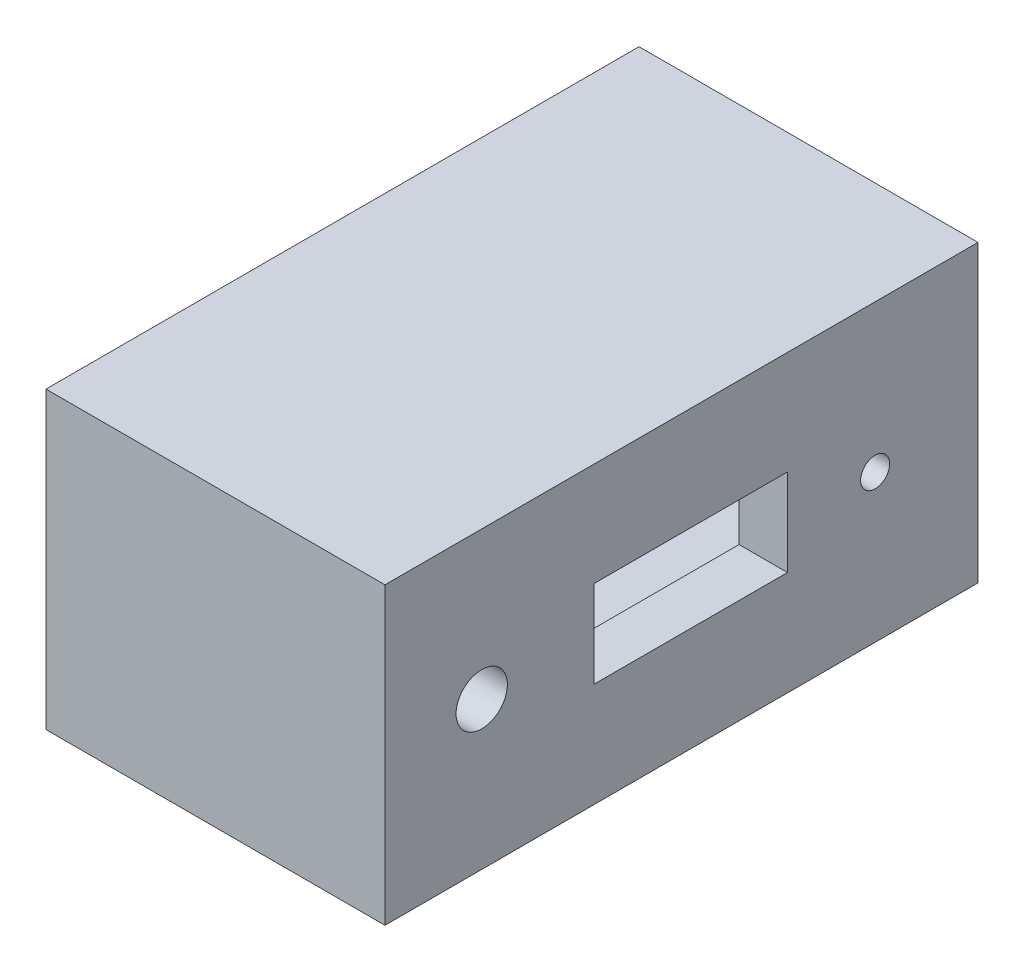
ISO-10303-21;
HEADER;
FILE_DESCRIPTION(('STEP AP214'),'2;1');
FILE_NAME('part.step','',(''),(''),'','','');
FILE_SCHEMA(('AUTOMOTIVE_DESIGN { 1 0 10303 214 1 1 1 1 }'));
ENDSEC;
DATA;
#1=APPLICATION_CONTEXT('core data for automotive mechanical design processes');
#2=APPLICATION_PROTOCOL_DEFINITION('international standard','automotive_design',2000,#1);
#3=PRODUCT_CONTEXT('',#1,'mechanical');
#4=PRODUCT('Part','Part','',(#3));
#5=PRODUCT_RELATED_PRODUCT_CATEGORY('part','',(#4));
#6=PRODUCT_DEFINITION_FORMATION('','',#4);
#7=PRODUCT_DEFINITION_CONTEXT('part definition',#1,'design');
#8=PRODUCT_DEFINITION('design','',#6,#7);
#9=PRODUCT_DEFINITION_SHAPE('','',#8);
#10=(LENGTH_UNIT() NAMED_UNIT(*) SI_UNIT(.MILLI.,.METRE.));
#11=(NAMED_UNIT(*) PLANE_ANGLE_UNIT() SI_UNIT($,.RADIAN.));
#12=(NAMED_UNIT(*) SI_UNIT($,.STERADIAN.) SOLID_ANGLE_UNIT());
#13=UNCERTAINTY_MEASURE_WITH_UNIT(LENGTH_MEASURE(1.E-05),#10,'distance_accuracy_value','');
#14=(GEOMETRIC_REPRESENTATION_CONTEXT(3) GLOBAL_UNCERTAINTY_ASSIGNED_CONTEXT((#13)) GLOBAL_UNIT_ASSIGNED_CONTEXT((#10,
#11,#12)) REPRESENTATION_CONTEXT('',''));
#15=CARTESIAN_POINT('',(0.,0.,0.));
#16=DIRECTION('',(0.,0.,1.));
#17=DIRECTION('',(1.,0.,0.));
#18=AXIS2_PLACEMENT_3D('',#15,#16,#17);
#19=CARTESIAN_POINT('',(3.5,0.,0.));
#20=DIRECTION('',(-1.,0.,0.));
#21=DIRECTION('',(0.,0.,1.));
#22=AXIS2_PLACEMENT_3D('',#19,#20,#21);
#23=PLANE('',#22);
#24=DIRECTION('',(0.,0.,-1.));
#25=VECTOR('',#24,1.);
#26=CARTESIAN_POINT('',(3.5,1.97665680775978,0.));
#27=LINE('',#26,#25);
#28=CARTESIAN_POINT('',(3.5,1.97665680775978,-2.15596234053682));
#29=VERTEX_POINT('',#28);
#30=CARTESIAN_POINT('',(3.5,1.97665680775978,-4.15596234053682));
#31=VERTEX_POINT('',#30);
#32=EDGE_CURVE('E152',#29,#31,#27,.T.);
#33=ORIENTED_EDGE('',*,*,#32,.T.);
#34=DIRECTION('',(0.,-1.,0.));
#35=VECTOR('',#34,1.);
#36=CARTESIAN_POINT('',(3.5,0.,-4.15596234053682));
#37=LINE('',#36,#35);
#38=CARTESIAN_POINT('',(3.5,1.07665680775978,-4.15596234053682));
#39=VERTEX_POINT('',#38);
#40=EDGE_CURVE('E146',#31,#39,#37,.T.);
#41=ORIENTED_EDGE('',*,*,#40,.T.);
#42=DIRECTION('',(0.,0.,-1.));
#43=VECTOR('',#42,1.);
#44=CARTESIAN_POINT('',(3.5,1.07665680775978,0.));
#45=LINE('',#44,#43);
#46=CARTESIAN_POINT('',(3.5,1.07665680775978,-2.15596234053682));
#47=VERTEX_POINT('',#46);
#48=EDGE_CURVE('E316',#47,#39,#45,.T.);
#49=ORIENTED_EDGE('',*,*,#48,.F.);
#50=DIRECTION('',(0.,-1.,0.));
#51=VECTOR('',#50,1.);
#52=CARTESIAN_POINT('',(3.5,0.,-2.15596234053682));
#53=LINE('',#52,#51);
#54=EDGE_CURVE('E133',#29,#47,#53,.T.);
#55=ORIENTED_EDGE('',*,*,#54,.F.);
#56=EDGE_LOOP('',(#33,#41,#49,#55));
#57=FACE_BOUND('',#56,.T.);
#58=DIRECTION('',(0.,-1.,0.));
#59=VECTOR('',#58,1.);
#60=CARTESIAN_POINT('',(3.5,0.,0.));
#61=LINE('',#60,#59);
#62=CARTESIAN_POINT('',(3.5,3.0449788556175,0.));
#63=VERTEX_POINT('',#62);
#64=CARTESIAN_POINT('',(3.5,0.,0.));
#65=VERTEX_POINT('',#64);
#66=EDGE_CURVE('E183',#63,#65,#61,.T.);
#67=ORIENTED_EDGE('',*,*,#66,.T.);
#68=DIRECTION('',(0.,0.,-1.));
#69=VECTOR('',#68,1.);
#70=CARTESIAN_POINT('',(3.5,0.,0.));
#71=LINE('',#70,#69);
#72=CARTESIAN_POINT('',(3.5,0.,-6.12325105517819));
#73=VERTEX_POINT('',#72);
#74=EDGE_CURVE('E186',#65,#73,#71,.T.);
#75=ORIENTED_EDGE('',*,*,#74,.T.);
#76=DIRECTION('',(0.,1.,0.));
#77=VECTOR('',#76,1.);
#78=CARTESIAN_POINT('',(3.5,0.,-6.12325105517819));
#79=LINE('',#78,#77);
#80=CARTESIAN_POINT('',(3.5,3.0449788556175,-6.12325105517819));
#81=VERTEX_POINT('',#80);
#82=EDGE_CURVE('E189',#73,#81,#79,.T.);
#83=ORIENTED_EDGE('',*,*,#82,.T.);
#84=DIRECTION('',(0.,0.,1.));
#85=VECTOR('',#84,1.);
#86=CARTESIAN_POINT('',(3.5,3.0449788556175,0.));
#87=LINE('',#86,#85);
#88=EDGE_CURVE('E191',#81,#63,#87,.T.);
#89=ORIENTED_EDGE('',*,*,#88,.T.);
#90=EDGE_LOOP('',(#67,#75,#83,#89));
#91=FACE_BOUND('',#90,.T.);
#92=CARTESIAN_POINT('',(3.5,1.52248942780875,-0.999206786961168));
#93=DIRECTION('',(-1.,0.,0.));
#94=DIRECTION('',(0.,0.,1.));
#95=AXIS2_PLACEMENT_3D('',#92,#93,#94);
#96=CIRCLE('',#95,0.265);
#97=CARTESIAN_POINT('',(3.5,1.52248942780875,-0.734206786961168));
#98=VERTEX_POINT('',#97);
#99=EDGE_CURVE('E145',#98,#98,#96,.F.);
#100=ORIENTED_EDGE('',*,*,#99,.F.);
#101=EDGE_LOOP('',(#100));
#102=FACE_BOUND('',#101,.T.);
#103=CARTESIAN_POINT('',(3.5,1.52248942780875,-5.06121810731853));
#104=DIRECTION('',(-1.,0.,0.));
#105=DIRECTION('',(0.,0.,1.));
#106=AXIS2_PLACEMENT_3D('',#103,#104,#105);
#107=CIRCLE('',#106,0.15);
#108=CARTESIAN_POINT('',(3.5,1.52248942780875,-4.91121810731853));
#109=VERTEX_POINT('',#108);
#110=EDGE_CURVE('E159',#109,#109,#107,.F.);
#111=ORIENTED_EDGE('',*,*,#110,.F.);
#112=EDGE_LOOP('',(#111));
#113=FACE_BOUND('',#112,.T.);
#114=ADVANCED_FACE('F33',(#57,#91,#102,#113),#23,.F.);
#115=CARTESIAN_POINT('',(3.,0.,0.));
#116=DIRECTION('',(1.,0.,0.));
#117=DIRECTION('',(0.,0.,-1.));
#118=AXIS2_PLACEMENT_3D('',#115,#116,#117);
#119=PLANE('',#118);
#120=DIRECTION('',(0.,0.,1.));
#121=VECTOR('',#120,1.);
#122=CARTESIAN_POINT('',(3.,1.07665680775978,0.));
#123=LINE('',#122,#121);
#124=CARTESIAN_POINT('',(3.,1.07665680775978,-4.15596234053682));
#125=VERTEX_POINT('',#124);
#126=CARTESIAN_POINT('',(3.,1.07665680775978,-2.15596234053682));
#127=VERTEX_POINT('',#126);
#128=EDGE_CURVE('E121',#125,#127,#123,.T.);
#129=ORIENTED_EDGE('',*,*,#128,.F.);
#130=DIRECTION('',(0.,1.,0.));
#131=VECTOR('',#130,1.);
#132=CARTESIAN_POINT('',(3.,0.,-4.15596234053682));
#133=LINE('',#132,#131);
#134=CARTESIAN_POINT('',(3.,1.97665680775978,-4.15596234053682));
#135=VERTEX_POINT('',#134);
#136=EDGE_CURVE('E11',#125,#135,#133,.T.);
#137=ORIENTED_EDGE('',*,*,#136,.T.);
#138=DIRECTION('',(0.,0.,1.));
#139=VECTOR('',#138,1.);
#140=CARTESIAN_POINT('',(3.,1.97665680775978,0.));
#141=LINE('',#140,#139);
#142=CARTESIAN_POINT('',(3.,1.97665680775978,-2.15596234053682));
#143=VERTEX_POINT('',#142);
#144=EDGE_CURVE('E42',#135,#143,#141,.T.);
#145=ORIENTED_EDGE('',*,*,#144,.T.);
#146=DIRECTION('',(0.,1.,0.));
#147=VECTOR('',#146,1.);
#148=CARTESIAN_POINT('',(3.,0.,-2.15596234053682));
#149=LINE('',#148,#147);
#150=EDGE_CURVE('E125',#127,#143,#149,.T.);
#151=ORIENTED_EDGE('',*,*,#150,.F.);
#152=EDGE_LOOP('',(#129,#137,#145,#151));
#153=FACE_BOUND('',#152,.T.);
#154=DIRECTION('',(0.,-1.,0.));
#155=VECTOR('',#154,1.);
#156=CARTESIAN_POINT('',(3.,2.89719891817419,-0.110841500333927));
#157=LINE('',#156,#155);
#158=CARTESIAN_POINT('',(3.,2.89719891817419,-0.110841500333927));
#159=VERTEX_POINT('',#158);
#160=CARTESIAN_POINT('',(3.,0.13723742030665,-0.110841500333927));
#161=VERTEX_POINT('',#160);
#162=EDGE_CURVE('E162',#159,#161,#157,.T.);
#163=ORIENTED_EDGE('',*,*,#162,.F.);
#164=DIRECTION('',(0.,0.,1.));
#165=VECTOR('',#164,1.);
#166=CARTESIAN_POINT('',(3.,2.89719891817419,-0.110841500333927));
#167=LINE('',#166,#165);
#168=CARTESIAN_POINT('',(3.,2.89719891817419,-5.99366600789935));
#169=VERTEX_POINT('',#168);
#170=EDGE_CURVE('E169',#169,#159,#167,.T.);
#171=ORIENTED_EDGE('',*,*,#170,.F.);
#172=DIRECTION('',(0.,1.,0.));
#173=VECTOR('',#172,1.);
#174=CARTESIAN_POINT('',(3.,2.89719891817419,-5.99366600789935));
#175=LINE('',#174,#173);
#176=CARTESIAN_POINT('',(3.,0.13723742030665,-5.99366600789935));
#177=VERTEX_POINT('',#176);
#178=EDGE_CURVE('E167',#177,#169,#175,.T.);
#179=ORIENTED_EDGE('',*,*,#178,.F.);
#180=DIRECTION('',(0.,0.,-1.));
#181=VECTOR('',#180,1.);
#182=CARTESIAN_POINT('',(3.,0.13723742030665,-0.110841500333927));
#183=LINE('',#182,#181);
#184=EDGE_CURVE('E165',#161,#177,#183,.T.);
#185=ORIENTED_EDGE('',*,*,#184,.F.);
#186=EDGE_LOOP('',(#163,#171,#179,#185));
#187=FACE_BOUND('',#186,.T.);
#188=CARTESIAN_POINT('',(3.,1.52248942780875,-0.999206786961168));
#189=DIRECTION('',(1.,0.,0.));
#190=DIRECTION('',(0.,0.,-1.));
#191=AXIS2_PLACEMENT_3D('',#188,#189,#190);
#192=CIRCLE('',#191,0.265);
#193=CARTESIAN_POINT('',(3.,1.52248942780875,-1.26420678696117));
#194=VERTEX_POINT('',#193);
#195=EDGE_CURVE('E143',#194,#194,#192,.F.);
#196=ORIENTED_EDGE('',*,*,#195,.F.);
#197=EDGE_LOOP('',(#196));
#198=FACE_BOUND('',#197,.T.);
#199=CARTESIAN_POINT('',(3.,1.52248942780875,-5.06121810731853));
#200=DIRECTION('',(1.,0.,0.));
#201=DIRECTION('',(0.,0.,-1.));
#202=AXIS2_PLACEMENT_3D('',#199,#200,#201);
#203=CIRCLE('',#202,0.15);
#204=CARTESIAN_POINT('',(3.,1.52248942780875,-5.21121810731853));
#205=VERTEX_POINT('',#204);
#206=EDGE_CURVE('E37',#205,#205,#203,.F.);
#207=ORIENTED_EDGE('',*,*,#206,.F.);
#208=EDGE_LOOP('',(#207));
#209=FACE_BOUND('',#208,.T.);
#210=ADVANCED_FACE('F138',(#153,#187,#198,#209),#119,.F.);
#211=CARTESIAN_POINT('',(0.,0.,0.));
#212=DIRECTION('',(-1.,0.,0.));
#213=DIRECTION('',(0.,0.,1.));
#214=AXIS2_PLACEMENT_3D('',#211,#212,#213);
#215=PLANE('',#214);
#216=DIRECTION('',(0.,-1.,0.));
#217=VECTOR('',#216,1.);
#218=CARTESIAN_POINT('',(0.,0.,0.));
#219=LINE('',#218,#217);
#220=CARTESIAN_POINT('',(0.,3.0449788556175,0.));
#221=VERTEX_POINT('',#220);
#222=CARTESIAN_POINT('',(0.,0.,0.));
#223=VERTEX_POINT('',#222);
#224=EDGE_CURVE('E182',#221,#223,#219,.T.);
#225=ORIENTED_EDGE('',*,*,#224,.F.);
#226=DIRECTION('',(0.,0.,1.));
#227=VECTOR('',#226,1.);
#228=CARTESIAN_POINT('',(0.,3.0449788556175,0.));
#229=LINE('',#228,#227);
#230=CARTESIAN_POINT('',(0.,3.0449788556175,-6.12325105517819));
#231=VERTEX_POINT('',#230);
#232=EDGE_CURVE('E187',#231,#221,#229,.T.);
#233=ORIENTED_EDGE('',*,*,#232,.F.);
#234=DIRECTION('',(0.,1.,0.));
#235=VECTOR('',#234,1.);
#236=CARTESIAN_POINT('',(0.,0.,-6.12325105517819));
#237=LINE('',#236,#235);
#238=CARTESIAN_POINT('',(0.,0.,-6.12325105517819));
#239=VERTEX_POINT('',#238);
#240=EDGE_CURVE('E198',#239,#231,#237,.T.);
#241=ORIENTED_EDGE('',*,*,#240,.F.);
#242=DIRECTION('',(0.,0.,-1.));
#243=VECTOR('',#242,1.);
#244=CARTESIAN_POINT('',(0.,0.,0.));
#245=LINE('',#244,#243);
#246=EDGE_CURVE('E196',#223,#239,#245,.T.);
#247=ORIENTED_EDGE('',*,*,#246,.F.);
#248=EDGE_LOOP('',(#225,#233,#241,#247));
#249=FACE_BOUND('',#248,.T.);
#250=DIRECTION('',(0.,0.,1.));
#251=VECTOR('',#250,1.);
#252=CARTESIAN_POINT('',(0.,2.89719891817419,0.));
#253=LINE('',#252,#251);
#254=CARTESIAN_POINT('',(0.,2.89719891817419,-5.99366600789935));
#255=VERTEX_POINT('',#254);
#256=CARTESIAN_POINT('',(0.,2.89719891817419,-0.110841500333927));
#257=VERTEX_POINT('',#256);
#258=EDGE_CURVE('E212',#255,#257,#253,.T.);
#259=ORIENTED_EDGE('',*,*,#258,.T.);
#260=DIRECTION('',(0.,-1.,0.));
#261=VECTOR('',#260,1.);
#262=CARTESIAN_POINT('',(0.,0.,-0.110841500333927));
#263=LINE('',#262,#261);
#264=CARTESIAN_POINT('',(0.,0.13723742030665,-0.110841500333927));
#265=VERTEX_POINT('',#264);
#266=EDGE_CURVE('E126',#257,#265,#263,.T.);
#267=ORIENTED_EDGE('',*,*,#266,.T.);
#268=DIRECTION('',(0.,0.,-1.));
#269=VECTOR('',#268,1.);
#270=CARTESIAN_POINT('',(0.,0.13723742030665,0.));
#271=LINE('',#270,#269);
#272=CARTESIAN_POINT('',(0.,0.13723742030665,-5.99366600789935));
#273=VERTEX_POINT('',#272);
#274=EDGE_CURVE('E218',#265,#273,#271,.T.);
#275=ORIENTED_EDGE('',*,*,#274,.T.);
#276=DIRECTION('',(0.,1.,0.));
#277=VECTOR('',#276,1.);
#278=CARTESIAN_POINT('',(0.,0.,-5.99366600789935));
#279=LINE('',#278,#277);
#280=EDGE_CURVE('E215',#273,#255,#279,.T.);
#281=ORIENTED_EDGE('',*,*,#280,.T.);
#282=EDGE_LOOP('',(#259,#267,#275,#281));
#283=FACE_BOUND('',#282,.T.);
#284=ADVANCED_FACE('F223',(#249,#283),#215,.T.);
#285=CARTESIAN_POINT('',(3.5,0.,0.));
#286=DIRECTION('',(0.,0.,-1.));
#287=DIRECTION('',(-1.,0.,0.));
#288=AXIS2_PLACEMENT_3D('',#285,#286,#287);
#289=PLANE('',#288);
#290=ORIENTED_EDGE('',*,*,#224,.T.);
#291=DIRECTION('',(-1.,0.,0.));
#292=VECTOR('',#291,1.);
#293=CARTESIAN_POINT('',(3.5,0.,0.));
#294=LINE('',#293,#292);
#295=EDGE_CURVE('E209',#65,#223,#294,.T.);
#296=ORIENTED_EDGE('',*,*,#295,.F.);
#297=ORIENTED_EDGE('',*,*,#66,.F.);
#298=DIRECTION('',(-1.,0.,0.));
#299=VECTOR('',#298,1.);
#300=CARTESIAN_POINT('',(3.5,3.0449788556175,0.));
#301=LINE('',#300,#299);
#302=EDGE_CURVE('E193',#63,#221,#301,.T.);
#303=ORIENTED_EDGE('',*,*,#302,.T.);
#304=EDGE_LOOP('',(#290,#296,#297,#303));
#305=FACE_BOUND('',#304,.T.);
#306=ADVANCED_FACE('F35',(#305),#289,.F.);
#307=CARTESIAN_POINT('',(3.5,0.,0.));
#308=DIRECTION('',(0.,1.,0.));
#309=DIRECTION('',(0.,0.,1.));
#310=AXIS2_PLACEMENT_3D('',#307,#308,#309);
#311=PLANE('',#310);
#312=ORIENTED_EDGE('',*,*,#246,.T.);
#313=DIRECTION('',(-1.,0.,0.));
#314=VECTOR('',#313,1.);
#315=CARTESIAN_POINT('',(3.5,0.,-6.12325105517819));
#316=LINE('',#315,#314);
#317=EDGE_CURVE('E206',#73,#239,#316,.T.);
#318=ORIENTED_EDGE('',*,*,#317,.F.);
#319=ORIENTED_EDGE('',*,*,#74,.F.);
#320=ORIENTED_EDGE('',*,*,#295,.T.);
#321=EDGE_LOOP('',(#312,#318,#319,#320));
#322=FACE_BOUND('',#321,.T.);
#323=ADVANCED_FACE('F270',(#322),#311,.F.);
#324=CARTESIAN_POINT('',(3.5,0.,-6.12325105517819));
#325=DIRECTION('',(0.,0.,1.));
#326=DIRECTION('',(1.,0.,0.));
#327=AXIS2_PLACEMENT_3D('',#324,#325,#326);
#328=PLANE('',#327);
#329=ORIENTED_EDGE('',*,*,#240,.T.);
#330=DIRECTION('',(-1.,0.,0.));
#331=VECTOR('',#330,1.);
#332=CARTESIAN_POINT('',(3.5,3.0449788556175,-6.12325105517819));
#333=LINE('',#332,#331);
#334=EDGE_CURVE('E203',#81,#231,#333,.T.);
#335=ORIENTED_EDGE('',*,*,#334,.F.);
#336=ORIENTED_EDGE('',*,*,#82,.F.);
#337=ORIENTED_EDGE('',*,*,#317,.T.);
#338=EDGE_LOOP('',(#329,#335,#336,#337));
#339=FACE_BOUND('',#338,.T.);
#340=ADVANCED_FACE('F267',(#339),#328,.F.);
#341=CARTESIAN_POINT('',(3.5,3.0449788556175,0.));
#342=DIRECTION('',(0.,-1.,0.));
#343=DIRECTION('',(0.,0.,-1.));
#344=AXIS2_PLACEMENT_3D('',#341,#342,#343);
#345=PLANE('',#344);
#346=ORIENTED_EDGE('',*,*,#232,.T.);
#347=ORIENTED_EDGE('',*,*,#302,.F.);
#348=ORIENTED_EDGE('',*,*,#88,.F.);
#349=ORIENTED_EDGE('',*,*,#334,.T.);
#350=EDGE_LOOP('',(#346,#347,#348,#349));
#351=FACE_BOUND('',#350,.T.);
#352=ADVANCED_FACE('F264',(#351),#345,.F.);
#353=CARTESIAN_POINT('',(3.,2.89719891817419,-0.110841500333927));
#354=DIRECTION('',(0.,0.,-1.));
#355=DIRECTION('',(-1.,0.,0.));
#356=AXIS2_PLACEMENT_3D('',#353,#354,#355);
#357=PLANE('',#356);
#358=DIRECTION('',(-1.,0.,0.));
#359=VECTOR('',#358,1.);
#360=CARTESIAN_POINT('',(3.,2.89719891817419,-0.110841500333927));
#361=LINE('',#360,#359);
#362=EDGE_CURVE('E171',#159,#257,#361,.T.);
#363=ORIENTED_EDGE('',*,*,#362,.F.);
#364=ORIENTED_EDGE('',*,*,#162,.T.);
#365=DIRECTION('',(-1.,0.,0.));
#366=VECTOR('',#365,1.);
#367=CARTESIAN_POINT('',(3.,0.13723742030665,-0.110841500333927));
#368=LINE('',#367,#366);
#369=EDGE_CURVE('E179',#161,#265,#368,.T.);
#370=ORIENTED_EDGE('',*,*,#369,.T.);
#371=ORIENTED_EDGE('',*,*,#266,.F.);
#372=EDGE_LOOP('',(#363,#364,#370,#371));
#373=FACE_BOUND('',#372,.T.);
#374=ADVANCED_FACE('F226',(#373),#357,.T.);
#375=CARTESIAN_POINT('',(3.,0.13723742030665,-0.110841500333927));
#376=DIRECTION('',(0.,1.,0.));
#377=DIRECTION('',(0.,0.,1.));
#378=AXIS2_PLACEMENT_3D('',#375,#376,#377);
#379=PLANE('',#378);
#380=ORIENTED_EDGE('',*,*,#369,.F.);
#381=ORIENTED_EDGE('',*,*,#184,.T.);
#382=DIRECTION('',(-1.,0.,0.));
#383=VECTOR('',#382,1.);
#384=CARTESIAN_POINT('',(3.,0.13723742030665,-5.99366600789935));
#385=LINE('',#384,#383);
#386=EDGE_CURVE('E176',#177,#273,#385,.T.);
#387=ORIENTED_EDGE('',*,*,#386,.T.);
#388=ORIENTED_EDGE('',*,*,#274,.F.);
#389=EDGE_LOOP('',(#380,#381,#387,#388));
#390=FACE_BOUND('',#389,.T.);
#391=ADVANCED_FACE('F230',(#390),#379,.T.);
#392=CARTESIAN_POINT('',(3.,2.89719891817419,-5.99366600789935));
#393=DIRECTION('',(0.,0.,1.));
#394=DIRECTION('',(1.,0.,0.));
#395=AXIS2_PLACEMENT_3D('',#392,#393,#394);
#396=PLANE('',#395);
#397=ORIENTED_EDGE('',*,*,#386,.F.);
#398=ORIENTED_EDGE('',*,*,#178,.T.);
#399=DIRECTION('',(-1.,0.,0.));
#400=VECTOR('',#399,1.);
#401=CARTESIAN_POINT('',(3.,2.89719891817419,-5.99366600789935));
#402=LINE('',#401,#400);
#403=EDGE_CURVE('E173',#169,#255,#402,.T.);
#404=ORIENTED_EDGE('',*,*,#403,.T.);
#405=ORIENTED_EDGE('',*,*,#280,.F.);
#406=EDGE_LOOP('',(#397,#398,#404,#405));
#407=FACE_BOUND('',#406,.T.);
#408=ADVANCED_FACE('F234',(#407),#396,.T.);
#409=CARTESIAN_POINT('',(3.,2.89719891817419,-0.110841500333927));
#410=DIRECTION('',(0.,-1.,0.));
#411=DIRECTION('',(0.,0.,-1.));
#412=AXIS2_PLACEMENT_3D('',#409,#410,#411);
#413=PLANE('',#412);
#414=ORIENTED_EDGE('',*,*,#403,.F.);
#415=ORIENTED_EDGE('',*,*,#170,.T.);
#416=ORIENTED_EDGE('',*,*,#362,.T.);
#417=ORIENTED_EDGE('',*,*,#258,.F.);
#418=EDGE_LOOP('',(#414,#415,#416,#417));
#419=FACE_BOUND('',#418,.T.);
#420=ADVANCED_FACE('F239',(#419),#413,.T.);
#421=CARTESIAN_POINT('',(19.,0.,-4.15596234053682));
#422=DIRECTION('',(0.,0.,-1.));
#423=DIRECTION('',(-1.,0.,0.));
#424=AXIS2_PLACEMENT_3D('',#421,#422,#423);
#425=PLANE('',#424);
#426=DIRECTION('',(-1.,0.,0.));
#427=VECTOR('',#426,1.);
#428=CARTESIAN_POINT('',(19.,1.97665680775978,-4.15596234053682));
#429=LINE('',#428,#427);
#430=EDGE_CURVE('E314',#31,#135,#429,.T.);
#431=ORIENTED_EDGE('',*,*,#430,.T.);
#432=ORIENTED_EDGE('',*,*,#136,.F.);
#433=DIRECTION('',(-1.,0.,0.));
#434=VECTOR('',#433,1.);
#435=CARTESIAN_POINT('',(19.,1.07665680775978,-4.15596234053682));
#436=LINE('',#435,#434);
#437=EDGE_CURVE('E55',#39,#125,#436,.T.);
#438=ORIENTED_EDGE('',*,*,#437,.F.);
#439=ORIENTED_EDGE('',*,*,#40,.F.);
#440=EDGE_LOOP('',(#431,#432,#438,#439));
#441=FACE_BOUND('',#440,.T.);
#442=ADVANCED_FACE('F241',(#441),#425,.F.);
#443=CARTESIAN_POINT('',(19.,1.97665680775978,0.));
#444=DIRECTION('',(0.,1.,0.));
#445=DIRECTION('',(0.,0.,1.));
#446=AXIS2_PLACEMENT_3D('',#443,#444,#445);
#447=PLANE('',#446);
#448=DIRECTION('',(-1.,0.,0.));
#449=VECTOR('',#448,1.);
#450=CARTESIAN_POINT('',(19.,1.97665680775978,-2.15596234053682));
#451=LINE('',#450,#449);
#452=EDGE_CURVE('E135',#29,#143,#451,.T.);
#453=ORIENTED_EDGE('',*,*,#452,.T.);
#454=ORIENTED_EDGE('',*,*,#144,.F.);
#455=ORIENTED_EDGE('',*,*,#430,.F.);
#456=ORIENTED_EDGE('',*,*,#32,.F.);
#457=EDGE_LOOP('',(#453,#454,#455,#456));
#458=FACE_BOUND('',#457,.T.);
#459=ADVANCED_FACE('F247',(#458),#447,.F.);
#460=CARTESIAN_POINT('',(19.,0.,-2.15596234053682));
#461=DIRECTION('',(0.,0.,-1.));
#462=DIRECTION('',(-1.,0.,0.));
#463=AXIS2_PLACEMENT_3D('',#460,#461,#462);
#464=PLANE('',#463);
#465=ORIENTED_EDGE('',*,*,#54,.T.);
#466=DIRECTION('',(-1.,0.,0.));
#467=VECTOR('',#466,1.);
#468=CARTESIAN_POINT('',(19.,1.07665680775978,-2.15596234053682));
#469=LINE('',#468,#467);
#470=EDGE_CURVE('E50',#47,#127,#469,.T.);
#471=ORIENTED_EDGE('',*,*,#470,.T.);
#472=ORIENTED_EDGE('',*,*,#150,.T.);
#473=ORIENTED_EDGE('',*,*,#452,.F.);
#474=EDGE_LOOP('',(#465,#471,#472,#473));
#475=FACE_BOUND('',#474,.T.);
#476=ADVANCED_FACE('F129',(#475),#464,.T.);
#477=CARTESIAN_POINT('',(19.,1.07665680775978,0.));
#478=DIRECTION('',(0.,1.,0.));
#479=DIRECTION('',(0.,0.,1.));
#480=AXIS2_PLACEMENT_3D('',#477,#478,#479);
#481=PLANE('',#480);
#482=ORIENTED_EDGE('',*,*,#48,.T.);
#483=ORIENTED_EDGE('',*,*,#437,.T.);
#484=ORIENTED_EDGE('',*,*,#128,.T.);
#485=ORIENTED_EDGE('',*,*,#470,.F.);
#486=EDGE_LOOP('',(#482,#483,#484,#485));
#487=FACE_BOUND('',#486,.T.);
#488=ADVANCED_FACE('F122',(#487),#481,.T.);
#489=CARTESIAN_POINT('',(19.,1.52248942780875,-0.999206786961168));
#490=DIRECTION('',(-1.,0.,0.));
#491=DIRECTION('',(0.,0.,1.));
#492=AXIS2_PLACEMENT_3D('',#489,#490,#491);
#493=CYLINDRICAL_SURFACE('',#492,0.265);
#494=ORIENTED_EDGE('',*,*,#195,.T.);
#495=EDGE_LOOP('',(#494));
#496=FACE_BOUND('',#495,.T.);
#497=ORIENTED_EDGE('',*,*,#99,.T.);
#498=EDGE_LOOP('',(#497));
#499=FACE_BOUND('',#498,.T.);
#500=ADVANCED_FACE('F295',(#496,#499),#493,.F.);
#501=CARTESIAN_POINT('',(19.,1.52248942780875,-5.06121810731853));
#502=DIRECTION('',(-1.,0.,0.));
#503=DIRECTION('',(0.,0.,1.));
#504=AXIS2_PLACEMENT_3D('',#501,#502,#503);
#505=CYLINDRICAL_SURFACE('',#504,0.15);
#506=ORIENTED_EDGE('',*,*,#206,.T.);
#507=EDGE_LOOP('',(#506));
#508=FACE_BOUND('',#507,.T.);
#509=ORIENTED_EDGE('',*,*,#110,.T.);
#510=EDGE_LOOP('',(#509));
#511=FACE_BOUND('',#510,.T.);
#512=ADVANCED_FACE('F293',(#508,#511),#505,.F.);
#513=CLOSED_SHELL('',(#114,#210,#284,#306,#323,#340,#352,#374,#391,#408,#420,#442,#459,#476,
#488,#500,#512));
#514=MANIFOLD_SOLID_BREP('B2',#513);
#515=ADVANCED_BREP_SHAPE_REPRESENTATION('',(#18,#514),#14);
#516=SHAPE_DEFINITION_REPRESENTATION(#9,#515);
ENDSEC;
END-ISO-10303-21;
